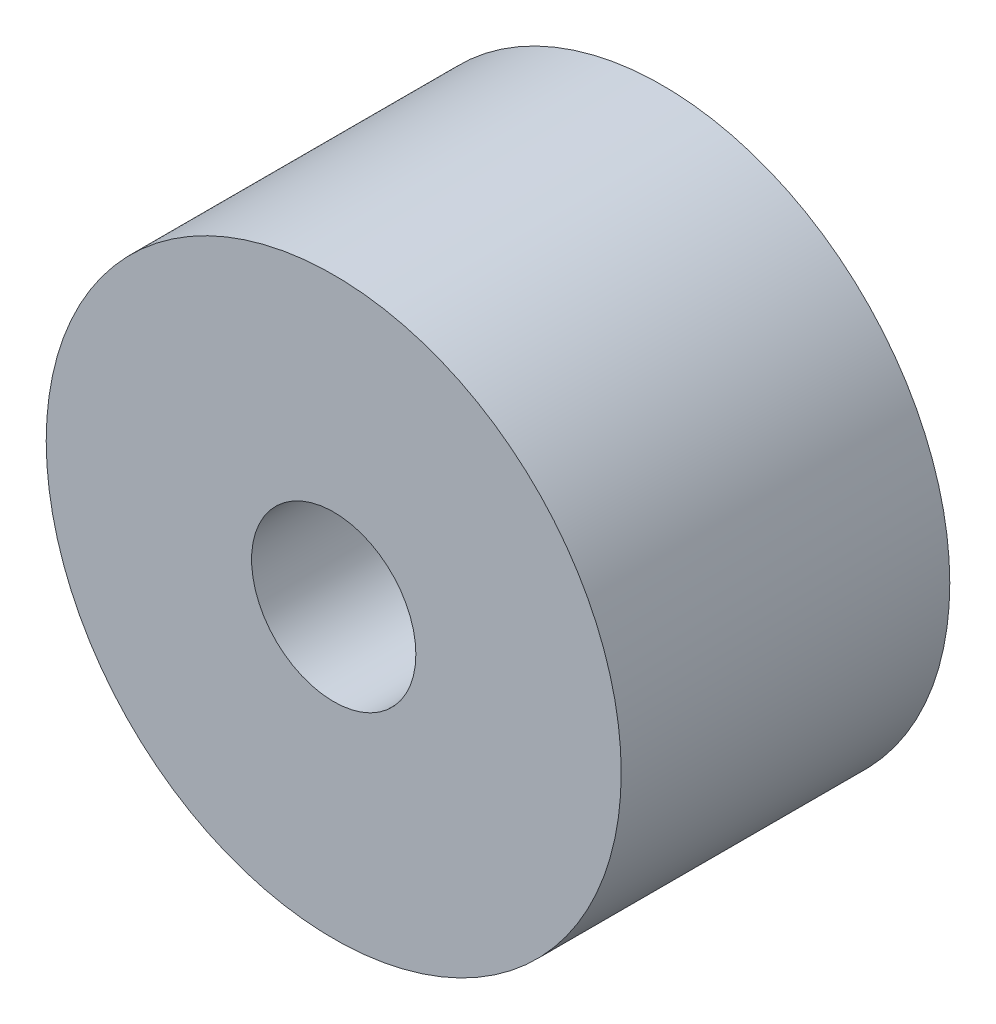
ISO-10303-21;
HEADER;
FILE_DESCRIPTION(('STEP AP214'),'2;1');
FILE_NAME('part.step','',(''),(''),'','','');
FILE_SCHEMA(('AUTOMOTIVE_DESIGN { 1 0 10303 214 1 1 1 1 }'));
ENDSEC;
DATA;
#1=APPLICATION_CONTEXT('core data for automotive mechanical design processes');
#2=APPLICATION_PROTOCOL_DEFINITION('international standard','automotive_design',2000,#1);
#3=PRODUCT_CONTEXT('',#1,'mechanical');
#4=PRODUCT('Part','Part','',(#3));
#5=PRODUCT_RELATED_PRODUCT_CATEGORY('part','',(#4));
#6=PRODUCT_DEFINITION_FORMATION('','',#4);
#7=PRODUCT_DEFINITION_CONTEXT('part definition',#1,'design');
#8=PRODUCT_DEFINITION('design','',#6,#7);
#9=PRODUCT_DEFINITION_SHAPE('','',#8);
#10=(LENGTH_UNIT() NAMED_UNIT(*) SI_UNIT(.MILLI.,.METRE.));
#11=(NAMED_UNIT(*) PLANE_ANGLE_UNIT() SI_UNIT($,.RADIAN.));
#12=(NAMED_UNIT(*) SI_UNIT($,.STERADIAN.) SOLID_ANGLE_UNIT());
#13=UNCERTAINTY_MEASURE_WITH_UNIT(LENGTH_MEASURE(1.E-05),#10,'distance_accuracy_value','');
#14=(GEOMETRIC_REPRESENTATION_CONTEXT(3) GLOBAL_UNCERTAINTY_ASSIGNED_CONTEXT((#13)) GLOBAL_UNIT_ASSIGNED_CONTEXT((#10,
#11,#12)) REPRESENTATION_CONTEXT('',''));
#15=CARTESIAN_POINT('',(0.,0.,0.));
#16=DIRECTION('',(0.,0.,1.));
#17=DIRECTION('',(1.,0.,0.));
#18=AXIS2_PLACEMENT_3D('',#15,#16,#17);
#19=CARTESIAN_POINT('',(0.,0.,10.));
#20=DIRECTION('',(0.,0.,1.));
#21=DIRECTION('',(1.,0.,0.));
#22=AXIS2_PLACEMENT_3D('',#19,#20,#21);
#23=PLANE('',#22);
#24=CARTESIAN_POINT('',(0.,0.,10.));
#25=DIRECTION('',(0.,0.,1.));
#26=DIRECTION('',(1.,0.,0.));
#27=AXIS2_PLACEMENT_3D('',#24,#25,#26);
#28=CIRCLE('',#27,17.5);
#29=CARTESIAN_POINT('',(17.5,0.,10.));
#30=VERTEX_POINT('',#29);
#31=EDGE_CURVE('E10',#30,#30,#28,.T.);
#32=ORIENTED_EDGE('',*,*,#31,.T.);
#33=EDGE_LOOP('',(#32));
#34=FACE_BOUND('',#33,.T.);
#35=CARTESIAN_POINT('',(0.,0.,10.));
#36=DIRECTION('',(0.,0.,1.));
#37=DIRECTION('',(1.,0.,0.));
#38=AXIS2_PLACEMENT_3D('',#35,#36,#37);
#39=CIRCLE('',#38,5.);
#40=CARTESIAN_POINT('',(5.,0.,10.));
#41=VERTEX_POINT('',#40);
#42=EDGE_CURVE('E50',#41,#41,#39,.T.);
#43=ORIENTED_EDGE('',*,*,#42,.F.);
#44=EDGE_LOOP('',(#43));
#45=FACE_BOUND('',#44,.T.);
#46=ADVANCED_FACE('F37',(#34,#45),#23,.T.);
#47=CARTESIAN_POINT('',(0.,0.,-10.));
#48=DIRECTION('',(0.,0.,1.));
#49=DIRECTION('',(1.,0.,0.));
#50=AXIS2_PLACEMENT_3D('',#47,#48,#49);
#51=PLANE('',#50);
#52=CARTESIAN_POINT('',(0.,0.,-10.));
#53=DIRECTION('',(0.,0.,1.));
#54=DIRECTION('',(1.,0.,0.));
#55=AXIS2_PLACEMENT_3D('',#52,#53,#54);
#56=CIRCLE('',#55,17.5);
#57=CARTESIAN_POINT('',(17.5,0.,-10.));
#58=VERTEX_POINT('',#57);
#59=EDGE_CURVE('E41',#58,#58,#56,.T.);
#60=ORIENTED_EDGE('',*,*,#59,.F.);
#61=EDGE_LOOP('',(#60));
#62=FACE_BOUND('',#61,.T.);
#63=CARTESIAN_POINT('',(0.,0.,-10.));
#64=DIRECTION('',(0.,0.,1.));
#65=DIRECTION('',(1.,0.,0.));
#66=AXIS2_PLACEMENT_3D('',#63,#64,#65);
#67=CIRCLE('',#66,5.);
#68=CARTESIAN_POINT('',(5.,0.,-10.));
#69=VERTEX_POINT('',#68);
#70=EDGE_CURVE('E52',#69,#69,#67,.T.);
#71=ORIENTED_EDGE('',*,*,#70,.T.);
#72=EDGE_LOOP('',(#71));
#73=FACE_BOUND('',#72,.T.);
#74=ADVANCED_FACE('F64',(#62,#73),#51,.F.);
#75=CARTESIAN_POINT('',(0.,0.,10.));
#76=DIRECTION('',(0.,0.,-1.));
#77=DIRECTION('',(-1.,0.,0.));
#78=AXIS2_PLACEMENT_3D('',#75,#76,#77);
#79=CYLINDRICAL_SURFACE('',#78,17.5);
#80=ORIENTED_EDGE('',*,*,#31,.F.);
#81=EDGE_LOOP('',(#80));
#82=FACE_BOUND('',#81,.T.);
#83=ORIENTED_EDGE('',*,*,#59,.T.);
#84=EDGE_LOOP('',(#83));
#85=FACE_BOUND('',#84,.T.);
#86=ADVANCED_FACE('F39',(#82,#85),#79,.T.);
#87=CARTESIAN_POINT('',(0.,0.,10.));
#88=DIRECTION('',(0.,0.,-1.));
#89=DIRECTION('',(-1.,0.,0.));
#90=AXIS2_PLACEMENT_3D('',#87,#88,#89);
#91=CYLINDRICAL_SURFACE('',#90,5.);
#92=ORIENTED_EDGE('',*,*,#42,.T.);
#93=EDGE_LOOP('',(#92));
#94=FACE_BOUND('',#93,.T.);
#95=ORIENTED_EDGE('',*,*,#70,.F.);
#96=EDGE_LOOP('',(#95));
#97=FACE_BOUND('',#96,.T.);
#98=ADVANCED_FACE('F60',(#94,#97),#91,.F.);
#99=CLOSED_SHELL('',(#46,#74,#86,#98));
#100=MANIFOLD_SOLID_BREP('B2',#99);
#101=ADVANCED_BREP_SHAPE_REPRESENTATION('',(#18,#100),#14);
#102=SHAPE_DEFINITION_REPRESENTATION(#9,#101);
ENDSEC;
END-ISO-10303-21;
